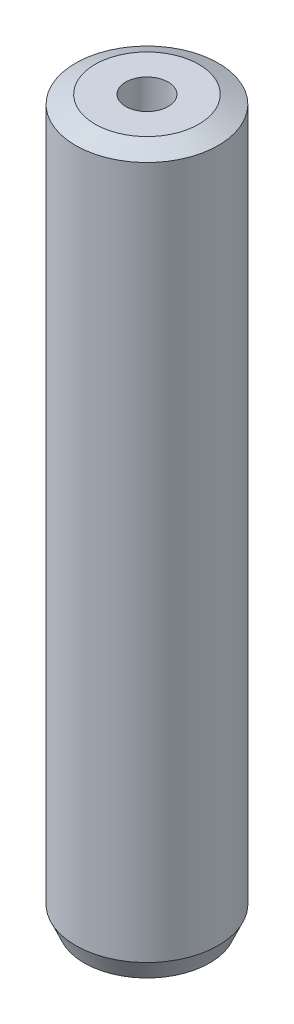
ISO-10303-21;
HEADER;
FILE_DESCRIPTION(('STEP AP214'),'2;1');
FILE_NAME('part.step','',(''),(''),'','','');
FILE_SCHEMA(('AUTOMOTIVE_DESIGN { 1 0 10303 214 1 1 1 1 }'));
ENDSEC;
DATA;
#1=APPLICATION_CONTEXT('core data for automotive mechanical design processes');
#2=APPLICATION_PROTOCOL_DEFINITION('international standard','automotive_design',2000,#1);
#3=PRODUCT_CONTEXT('',#1,'mechanical');
#4=PRODUCT('Part','Part','',(#3));
#5=PRODUCT_RELATED_PRODUCT_CATEGORY('part','',(#4));
#6=PRODUCT_DEFINITION_FORMATION('','',#4);
#7=PRODUCT_DEFINITION_CONTEXT('part definition',#1,'design');
#8=PRODUCT_DEFINITION('design','',#6,#7);
#9=PRODUCT_DEFINITION_SHAPE('','',#8);
#10=(LENGTH_UNIT() NAMED_UNIT(*) SI_UNIT(.MILLI.,.METRE.));
#11=(NAMED_UNIT(*) PLANE_ANGLE_UNIT() SI_UNIT($,.RADIAN.));
#12=(NAMED_UNIT(*) SI_UNIT($,.STERADIAN.) SOLID_ANGLE_UNIT());
#13=UNCERTAINTY_MEASURE_WITH_UNIT(LENGTH_MEASURE(1.E-05),#10,'distance_accuracy_value','');
#14=(GEOMETRIC_REPRESENTATION_CONTEXT(3) GLOBAL_UNCERTAINTY_ASSIGNED_CONTEXT((#13)) GLOBAL_UNIT_ASSIGNED_CONTEXT((#10,
#11,#12)) REPRESENTATION_CONTEXT('',''));
#15=CARTESIAN_POINT('',(0.,0.,0.));
#16=DIRECTION('',(0.,0.,1.));
#17=DIRECTION('',(1.,0.,0.));
#18=AXIS2_PLACEMENT_3D('',#15,#16,#17);
#19=CARTESIAN_POINT('',(0.,429.365131934212,0.));
#20=DIRECTION('',(0.,-1.,0.));
#21=DIRECTION('',(0.,0.,-1.));
#22=AXIS2_PLACEMENT_3D('',#19,#20,#21);
#23=CYLINDRICAL_SURFACE('',#22,42.5);
#24=CARTESIAN_POINT('',(0.,424.211687114443,0.));
#25=DIRECTION('',(0.,1.,0.));
#26=DIRECTION('',(0.,0.,1.));
#27=AXIS2_PLACEMENT_3D('',#24,#25,#26);
#28=CIRCLE('',#27,42.5);
#29=CARTESIAN_POINT('',(0.,424.211687114443,42.5));
#30=VERTEX_POINT('',#29);
#31=EDGE_CURVE('E50',#30,#30,#28,.F.);
#32=ORIENTED_EDGE('',*,*,#31,.T.);
#33=EDGE_LOOP('',(#32));
#34=FACE_BOUND('',#33,.T.);
#35=CARTESIAN_POINT('',(0.,11.6166120533364,0.));
#36=DIRECTION('',(0.,1.,0.));
#37=DIRECTION('',(0.,0.,1.));
#38=AXIS2_PLACEMENT_3D('',#35,#36,#37);
#39=CIRCLE('',#38,42.5);
#40=CARTESIAN_POINT('',(0.,11.6166120533364,42.5));
#41=VERTEX_POINT('',#40);
#42=EDGE_CURVE('E51',#41,#41,#39,.T.);
#43=ORIENTED_EDGE('',*,*,#42,.T.);
#44=EDGE_LOOP('',(#43));
#45=FACE_BOUND('',#44,.T.);
#46=ADVANCED_FACE('F39',(#34,#45),#23,.T.);
#47=CARTESIAN_POINT('',(0.,429.365131934212,0.));
#48=DIRECTION('',(0.,1.,0.));
#49=DIRECTION('',(0.,0.,1.));
#50=AXIS2_PLACEMENT_3D('',#47,#48,#49);
#51=PLANE('',#50);
#52=CARTESIAN_POINT('',(0.,429.365131934212,0.));
#53=DIRECTION('',(0.,1.,0.));
#54=DIRECTION('',(0.,0.,1.));
#55=AXIS2_PLACEMENT_3D('',#52,#53,#54);
#56=CIRCLE('',#55,30.8833879466636);
#57=CARTESIAN_POINT('',(0.,429.365131934212,30.8833879466636));
#58=VERTEX_POINT('',#57);
#59=EDGE_CURVE('E54',#58,#58,#56,.T.);
#60=ORIENTED_EDGE('',*,*,#59,.T.);
#61=EDGE_LOOP('',(#60));
#62=FACE_BOUND('',#61,.T.);
#63=CARTESIAN_POINT('',(0.,429.365131934212,0.));
#64=DIRECTION('',(0.,1.,0.));
#65=DIRECTION('',(0.,0.,1.));
#66=AXIS2_PLACEMENT_3D('',#63,#64,#65);
#67=CIRCLE('',#66,12.6314091743148);
#68=CARTESIAN_POINT('',(0.,429.365131934212,12.6314091743148));
#69=VERTEX_POINT('',#68);
#70=EDGE_CURVE('E58',#69,#69,#67,.T.);
#71=ORIENTED_EDGE('',*,*,#70,.F.);
#72=EDGE_LOOP('',(#71));
#73=FACE_BOUND('',#72,.T.);
#74=ADVANCED_FACE('F69',(#62,#73),#51,.T.);
#75=CARTESIAN_POINT('',(0.,0.,0.));
#76=DIRECTION('',(0.,1.,0.));
#77=DIRECTION('',(0.,0.,1.));
#78=AXIS2_PLACEMENT_3D('',#75,#76,#77);
#79=PLANE('',#78);
#80=CARTESIAN_POINT('',(0.,0.,0.));
#81=DIRECTION('',(0.,1.,0.));
#82=DIRECTION('',(0.,0.,1.));
#83=AXIS2_PLACEMENT_3D('',#80,#81,#82);
#84=CIRCLE('',#83,37.3465551802312);
#85=CARTESIAN_POINT('',(0.,0.,37.3465551802312));
#86=VERTEX_POINT('',#85);
#87=EDGE_CURVE('E10',#86,#86,#84,.F.);
#88=ORIENTED_EDGE('',*,*,#87,.T.);
#89=EDGE_LOOP('',(#88));
#90=FACE_BOUND('',#89,.T.);
#91=CARTESIAN_POINT('',(0.,0.,0.));
#92=DIRECTION('',(0.,1.,0.));
#93=DIRECTION('',(0.,0.,1.));
#94=AXIS2_PLACEMENT_3D('',#91,#92,#93);
#95=CIRCLE('',#94,12.6314091743148);
#96=CARTESIAN_POINT('',(0.,0.,12.6314091743148));
#97=VERTEX_POINT('',#96);
#98=EDGE_CURVE('E63',#97,#97,#95,.T.);
#99=ORIENTED_EDGE('',*,*,#98,.T.);
#100=EDGE_LOOP('',(#99));
#101=FACE_BOUND('',#100,.T.);
#102=ADVANCED_FACE('F75',(#90,#101),#79,.F.);
#103=CARTESIAN_POINT('',(0.,429.365131934212,0.));
#104=DIRECTION('',(0.,-1.,0.));
#105=DIRECTION('',(0.,0.,-1.));
#106=AXIS2_PLACEMENT_3D('',#103,#104,#105);
#107=CYLINDRICAL_SURFACE('',#106,12.6314091743148);
#108=ORIENTED_EDGE('',*,*,#70,.T.);
#109=EDGE_LOOP('',(#108));
#110=FACE_BOUND('',#109,.T.);
#111=ORIENTED_EDGE('',*,*,#98,.F.);
#112=EDGE_LOOP('',(#111));
#113=FACE_BOUND('',#112,.T.);
#114=ADVANCED_FACE('F70',(#110,#113),#107,.F.);
#115=CARTESIAN_POINT('',(0.,429.365131934212,0.));
#116=DIRECTION('',(0.,-1.,0.));
#117=DIRECTION('',(0.,0.,-1.));
#118=AXIS2_PLACEMENT_3D('',#115,#116,#117);
#119=CONICAL_SURFACE('',#118,30.8833879466636,1.15325466402382);
#120=ORIENTED_EDGE('',*,*,#31,.F.);
#121=EDGE_LOOP('',(#120));
#122=FACE_BOUND('',#121,.T.);
#123=ORIENTED_EDGE('',*,*,#59,.F.);
#124=EDGE_LOOP('',(#123));
#125=FACE_BOUND('',#124,.T.);
#126=ADVANCED_FACE('F81',(#122,#125),#119,.T.);
#127=CARTESIAN_POINT('',(0.,11.6166120533364,0.));
#128=DIRECTION('',(0.,1.,0.));
#129=DIRECTION('',(0.,0.,1.));
#130=AXIS2_PLACEMENT_3D('',#127,#128,#129);
#131=CONICAL_SURFACE('',#130,42.5,0.417541662771074);
#132=ORIENTED_EDGE('',*,*,#87,.F.);
#133=EDGE_LOOP('',(#132));
#134=FACE_BOUND('',#133,.T.);
#135=ORIENTED_EDGE('',*,*,#42,.F.);
#136=EDGE_LOOP('',(#135));
#137=FACE_BOUND('',#136,.T.);
#138=ADVANCED_FACE('F45',(#134,#137),#131,.T.);
#139=CLOSED_SHELL('',(#46,#74,#102,#114,#126,#138));
#140=MANIFOLD_SOLID_BREP('B2',#139);
#141=ADVANCED_BREP_SHAPE_REPRESENTATION('',(#18,#140),#14);
#142=SHAPE_DEFINITION_REPRESENTATION(#9,#141);
ENDSEC;
END-ISO-10303-21;
